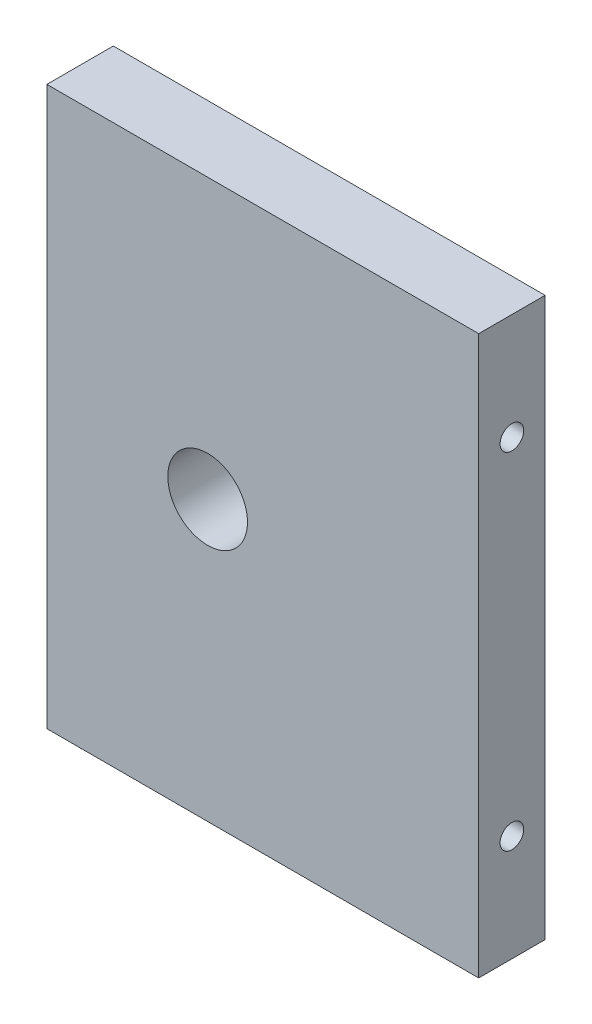
ISO-10303-21;
HEADER;
FILE_DESCRIPTION(('STEP AP214'),'2;1');
FILE_NAME('part.step','',(''),(''),'','','');
FILE_SCHEMA(('AUTOMOTIVE_DESIGN { 1 0 10303 214 1 1 1 1 }'));
ENDSEC;
DATA;
#1=APPLICATION_CONTEXT('core data for automotive mechanical design processes');
#2=APPLICATION_PROTOCOL_DEFINITION('international standard','automotive_design',2000,#1);
#3=PRODUCT_CONTEXT('',#1,'mechanical');
#4=PRODUCT('Part','Part','',(#3));
#5=PRODUCT_RELATED_PRODUCT_CATEGORY('part','',(#4));
#6=PRODUCT_DEFINITION_FORMATION('','',#4);
#7=PRODUCT_DEFINITION_CONTEXT('part definition',#1,'design');
#8=PRODUCT_DEFINITION('design','',#6,#7);
#9=PRODUCT_DEFINITION_SHAPE('','',#8);
#10=(LENGTH_UNIT() NAMED_UNIT(*) SI_UNIT(.MILLI.,.METRE.));
#11=(NAMED_UNIT(*) PLANE_ANGLE_UNIT() SI_UNIT($,.RADIAN.));
#12=(NAMED_UNIT(*) SI_UNIT($,.STERADIAN.) SOLID_ANGLE_UNIT());
#13=UNCERTAINTY_MEASURE_WITH_UNIT(LENGTH_MEASURE(1.E-05),#10,'distance_accuracy_value','');
#14=(GEOMETRIC_REPRESENTATION_CONTEXT(3) GLOBAL_UNCERTAINTY_ASSIGNED_CONTEXT((#13)) GLOBAL_UNIT_ASSIGNED_CONTEXT((#10,
#11,#12)) REPRESENTATION_CONTEXT('',''));
#15=CARTESIAN_POINT('',(0.,0.,0.));
#16=DIRECTION('',(0.,0.,1.));
#17=DIRECTION('',(1.,0.,0.));
#18=AXIS2_PLACEMENT_3D('',#15,#16,#17);
#19=CARTESIAN_POINT('',(0.,0.,5.));
#20=DIRECTION('',(1.,0.,0.));
#21=DIRECTION('',(0.,0.,-1.));
#22=AXIS2_PLACEMENT_3D('',#19,#20,#21);
#23=PLANE('',#22);
#24=CARTESIAN_POINT('',(0.,34.,2.5));
#25=DIRECTION('',(-1.,0.,0.));
#26=DIRECTION('',(0.,0.,1.));
#27=AXIS2_PLACEMENT_3D('',#24,#25,#26);
#28=CIRCLE('',#27,0.889000000000001);
#29=CARTESIAN_POINT('',(0.,34.,3.389));
#30=VERTEX_POINT('',#29);
#31=EDGE_CURVE('E133',#30,#30,#28,.T.);
#32=ORIENTED_EDGE('',*,*,#31,.F.);
#33=EDGE_LOOP('',(#32));
#34=FACE_BOUND('',#33,.T.);
#35=CARTESIAN_POINT('',(0.,8.,2.5));
#36=DIRECTION('',(-1.,0.,0.));
#37=DIRECTION('',(0.,0.,1.));
#38=AXIS2_PLACEMENT_3D('',#35,#36,#37);
#39=CIRCLE('',#38,0.888999999999999);
#40=CARTESIAN_POINT('',(0.,8.,3.389));
#41=VERTEX_POINT('',#40);
#42=EDGE_CURVE('E141',#41,#41,#39,.T.);
#43=ORIENTED_EDGE('',*,*,#42,.F.);
#44=EDGE_LOOP('',(#43));
#45=FACE_BOUND('',#44,.T.);
#46=DIRECTION('',(0.,-1.,0.));
#47=VECTOR('',#46,1.);
#48=CARTESIAN_POINT('',(0.,0.,0.));
#49=LINE('',#48,#47);
#50=CARTESIAN_POINT('',(0.,42.,0.));
#51=VERTEX_POINT('',#50);
#52=CARTESIAN_POINT('',(0.,0.,0.));
#53=VERTEX_POINT('',#52);
#54=EDGE_CURVE('E149',#51,#53,#49,.T.);
#55=ORIENTED_EDGE('',*,*,#54,.T.);
#56=DIRECTION('',(0.,0.,-1.));
#57=VECTOR('',#56,1.);
#58=CARTESIAN_POINT('',(0.,0.,5.));
#59=LINE('',#58,#57);
#60=CARTESIAN_POINT('',(0.,0.,5.));
#61=VERTEX_POINT('',#60);
#62=EDGE_CURVE('E11',#61,#53,#59,.T.);
#63=ORIENTED_EDGE('',*,*,#62,.F.);
#64=DIRECTION('',(0.,-1.,0.));
#65=VECTOR('',#64,1.);
#66=CARTESIAN_POINT('',(0.,0.,5.));
#67=LINE('',#66,#65);
#68=CARTESIAN_POINT('',(0.,42.,5.));
#69=VERTEX_POINT('',#68);
#70=EDGE_CURVE('E150',#69,#61,#67,.T.);
#71=ORIENTED_EDGE('',*,*,#70,.F.);
#72=DIRECTION('',(0.,0.,-1.));
#73=VECTOR('',#72,1.);
#74=CARTESIAN_POINT('',(0.,42.,5.));
#75=LINE('',#74,#73);
#76=EDGE_CURVE('E160',#69,#51,#75,.T.);
#77=ORIENTED_EDGE('',*,*,#76,.T.);
#78=EDGE_LOOP('',(#55,#63,#71,#77));
#79=FACE_BOUND('',#78,.T.);
#80=ADVANCED_FACE('F45',(#34,#45,#79),#23,.F.);
#81=CARTESIAN_POINT('',(0.,0.,5.));
#82=DIRECTION('',(0.,1.,0.));
#83=DIRECTION('',(0.,0.,1.));
#84=AXIS2_PLACEMENT_3D('',#81,#82,#83);
#85=PLANE('',#84);
#86=DIRECTION('',(1.,0.,0.));
#87=VECTOR('',#86,1.);
#88=CARTESIAN_POINT('',(0.,0.,0.));
#89=LINE('',#88,#87);
#90=CARTESIAN_POINT('',(32.5,0.,0.));
#91=VERTEX_POINT('',#90);
#92=EDGE_CURVE('E164',#53,#91,#89,.T.);
#93=ORIENTED_EDGE('',*,*,#92,.T.);
#94=DIRECTION('',(0.,0.,-1.));
#95=VECTOR('',#94,1.);
#96=CARTESIAN_POINT('',(32.5,0.,5.));
#97=LINE('',#96,#95);
#98=CARTESIAN_POINT('',(32.5,0.,5.));
#99=VERTEX_POINT('',#98);
#100=EDGE_CURVE('E54',#99,#91,#97,.T.);
#101=ORIENTED_EDGE('',*,*,#100,.F.);
#102=DIRECTION('',(1.,0.,0.));
#103=VECTOR('',#102,1.);
#104=CARTESIAN_POINT('',(0.,0.,5.));
#105=LINE('',#104,#103);
#106=EDGE_CURVE('E93',#61,#99,#105,.T.);
#107=ORIENTED_EDGE('',*,*,#106,.F.);
#108=ORIENTED_EDGE('',*,*,#62,.T.);
#109=EDGE_LOOP('',(#93,#101,#107,#108));
#110=FACE_BOUND('',#109,.T.);
#111=ADVANCED_FACE('F194',(#110),#85,.F.);
#112=CARTESIAN_POINT('',(32.5,0.,5.));
#113=DIRECTION('',(-1.,0.,0.));
#114=DIRECTION('',(0.,0.,1.));
#115=AXIS2_PLACEMENT_3D('',#112,#113,#114);
#116=PLANE('',#115);
#117=CARTESIAN_POINT('',(32.5,34.,2.5));
#118=DIRECTION('',(1.,0.,0.));
#119=DIRECTION('',(0.,0.,-1.));
#120=AXIS2_PLACEMENT_3D('',#117,#118,#119);
#121=CIRCLE('',#120,0.888999999999987);
#122=CARTESIAN_POINT('',(32.5,34.,1.61100000000001));
#123=VERTEX_POINT('',#122);
#124=EDGE_CURVE('E118',#123,#123,#121,.T.);
#125=ORIENTED_EDGE('',*,*,#124,.F.);
#126=EDGE_LOOP('',(#125));
#127=FACE_BOUND('',#126,.T.);
#128=CARTESIAN_POINT('',(32.5,8.,2.5));
#129=DIRECTION('',(1.,0.,0.));
#130=DIRECTION('',(0.,0.,-1.));
#131=AXIS2_PLACEMENT_3D('',#128,#129,#130);
#132=CIRCLE('',#131,0.888999999999989);
#133=CARTESIAN_POINT('',(32.5,8.,1.61100000000001));
#134=VERTEX_POINT('',#133);
#135=EDGE_CURVE('E117',#134,#134,#132,.T.);
#136=ORIENTED_EDGE('',*,*,#135,.F.);
#137=EDGE_LOOP('',(#136));
#138=FACE_BOUND('',#137,.T.);
#139=DIRECTION('',(0.,1.,0.));
#140=VECTOR('',#139,1.);
#141=CARTESIAN_POINT('',(32.5,0.,0.));
#142=LINE('',#141,#140);
#143=CARTESIAN_POINT('',(32.5,42.,0.));
#144=VERTEX_POINT('',#143);
#145=EDGE_CURVE('E80',#91,#144,#142,.T.);
#146=ORIENTED_EDGE('',*,*,#145,.T.);
#147=DIRECTION('',(0.,0.,-1.));
#148=VECTOR('',#147,1.);
#149=CARTESIAN_POINT('',(32.5,42.,5.));
#150=LINE('',#149,#148);
#151=CARTESIAN_POINT('',(32.5,42.,5.));
#152=VERTEX_POINT('',#151);
#153=EDGE_CURVE('E173',#152,#144,#150,.T.);
#154=ORIENTED_EDGE('',*,*,#153,.F.);
#155=DIRECTION('',(0.,1.,0.));
#156=VECTOR('',#155,1.);
#157=CARTESIAN_POINT('',(32.5,0.,5.));
#158=LINE('',#157,#156);
#159=EDGE_CURVE('E155',#99,#152,#158,.T.);
#160=ORIENTED_EDGE('',*,*,#159,.F.);
#161=ORIENTED_EDGE('',*,*,#100,.T.);
#162=EDGE_LOOP('',(#146,#154,#160,#161));
#163=FACE_BOUND('',#162,.T.);
#164=ADVANCED_FACE('F177',(#127,#138,#163),#116,.F.);
#165=CARTESIAN_POINT('',(0.,42.,5.));
#166=DIRECTION('',(0.,-1.,0.));
#167=DIRECTION('',(0.,0.,-1.));
#168=AXIS2_PLACEMENT_3D('',#165,#166,#167);
#169=PLANE('',#168);
#170=DIRECTION('',(-1.,0.,0.));
#171=VECTOR('',#170,1.);
#172=CARTESIAN_POINT('',(0.,42.,0.));
#173=LINE('',#172,#171);
#174=EDGE_CURVE('E86',#144,#51,#173,.T.);
#175=ORIENTED_EDGE('',*,*,#174,.T.);
#176=ORIENTED_EDGE('',*,*,#76,.F.);
#177=DIRECTION('',(-1.,0.,0.));
#178=VECTOR('',#177,1.);
#179=CARTESIAN_POINT('',(0.,42.,5.));
#180=LINE('',#179,#178);
#181=EDGE_CURVE('E62',#152,#69,#180,.T.);
#182=ORIENTED_EDGE('',*,*,#181,.F.);
#183=ORIENTED_EDGE('',*,*,#153,.T.);
#184=EDGE_LOOP('',(#175,#176,#182,#183));
#185=FACE_BOUND('',#184,.T.);
#186=ADVANCED_FACE('F184',(#185),#169,.F.);
#187=CARTESIAN_POINT('',(0.,0.,5.));
#188=DIRECTION('',(0.,0.,-1.));
#189=DIRECTION('',(-1.,0.,0.));
#190=AXIS2_PLACEMENT_3D('',#187,#188,#189);
#191=PLANE('',#190);
#192=CARTESIAN_POINT('',(12.1,21.,5.));
#193=DIRECTION('',(0.,0.,-1.));
#194=DIRECTION('',(-1.,0.,0.));
#195=AXIS2_PLACEMENT_3D('',#192,#193,#194);
#196=CIRCLE('',#195,3.);
#197=CARTESIAN_POINT('',(9.1,21.,5.));
#198=VERTEX_POINT('',#197);
#199=EDGE_CURVE('E126',#198,#198,#196,.T.);
#200=ORIENTED_EDGE('',*,*,#199,.T.);
#201=EDGE_LOOP('',(#200));
#202=FACE_BOUND('',#201,.T.);
#203=ORIENTED_EDGE('',*,*,#70,.T.);
#204=ORIENTED_EDGE('',*,*,#106,.T.);
#205=ORIENTED_EDGE('',*,*,#159,.T.);
#206=ORIENTED_EDGE('',*,*,#181,.T.);
#207=EDGE_LOOP('',(#203,#204,#205,#206));
#208=FACE_BOUND('',#207,.T.);
#209=ADVANCED_FACE('F186',(#202,#208),#191,.F.);
#210=CARTESIAN_POINT('',(0.,0.,0.));
#211=DIRECTION('',(0.,0.,-1.));
#212=DIRECTION('',(-1.,0.,0.));
#213=AXIS2_PLACEMENT_3D('',#210,#211,#212);
#214=PLANE('',#213);
#215=CARTESIAN_POINT('',(12.1,21.,0.));
#216=DIRECTION('',(0.,0.,-1.));
#217=DIRECTION('',(-1.,0.,0.));
#218=AXIS2_PLACEMENT_3D('',#215,#216,#217);
#219=CIRCLE('',#218,3.);
#220=CARTESIAN_POINT('',(9.1,21.,0.));
#221=VERTEX_POINT('',#220);
#222=EDGE_CURVE('E230',#221,#221,#219,.T.);
#223=ORIENTED_EDGE('',*,*,#222,.F.);
#224=EDGE_LOOP('',(#223));
#225=FACE_BOUND('',#224,.T.);
#226=ORIENTED_EDGE('',*,*,#54,.F.);
#227=ORIENTED_EDGE('',*,*,#174,.F.);
#228=ORIENTED_EDGE('',*,*,#145,.F.);
#229=ORIENTED_EDGE('',*,*,#92,.F.);
#230=EDGE_LOOP('',(#226,#227,#228,#229));
#231=FACE_BOUND('',#230,.T.);
#232=ADVANCED_FACE('F180',(#225,#231),#214,.T.);
#233=CARTESIAN_POINT('',(7.4658349096845,8.,2.5));
#234=DIRECTION('',(-1.,0.,0.));
#235=DIRECTION('',(0.,0.,1.));
#236=AXIS2_PLACEMENT_3D('',#233,#234,#235);
#237=CONICAL_SURFACE('',#236,0.888999999999999,1.02974425867665);
#238=CARTESIAN_POINT('',(8.,8.,2.5));
#239=VERTEX_POINT('',#238);
#240=VERTEX_LOOP('',#239);
#241=FACE_BOUND('',#240,.T.);
#242=CARTESIAN_POINT('',(7.4658349096845,8.,2.5));
#243=DIRECTION('',(-1.,0.,0.));
#244=DIRECTION('',(0.,0.,1.));
#245=AXIS2_PLACEMENT_3D('',#242,#243,#244);
#246=CIRCLE('',#245,0.888999999999999);
#247=CARTESIAN_POINT('',(7.4658349096845,8.,3.389));
#248=VERTEX_POINT('',#247);
#249=EDGE_CURVE('E145',#248,#248,#246,.T.);
#250=ORIENTED_EDGE('',*,*,#249,.T.);
#251=EDGE_LOOP('',(#250));
#252=FACE_BOUND('',#251,.T.);
#253=ADVANCED_FACE('F210',(#241,#252),#237,.F.);
#254=CARTESIAN_POINT('',(0.,8.,2.5));
#255=DIRECTION('',(-1.,0.,0.));
#256=DIRECTION('',(0.,0.,1.));
#257=AXIS2_PLACEMENT_3D('',#254,#255,#256);
#258=CYLINDRICAL_SURFACE('',#257,0.888999999999999);
#259=ORIENTED_EDGE('',*,*,#249,.F.);
#260=EDGE_LOOP('',(#259));
#261=FACE_BOUND('',#260,.T.);
#262=ORIENTED_EDGE('',*,*,#42,.T.);
#263=EDGE_LOOP('',(#262));
#264=FACE_BOUND('',#263,.T.);
#265=ADVANCED_FACE('F207',(#261,#264),#258,.F.);
#266=CARTESIAN_POINT('',(7.4658349096845,34.,2.5));
#267=DIRECTION('',(-1.,0.,0.));
#268=DIRECTION('',(0.,0.,1.));
#269=AXIS2_PLACEMENT_3D('',#266,#267,#268);
#270=CONICAL_SURFACE('',#269,0.889000000000001,1.02974425867665);
#271=CARTESIAN_POINT('',(8.,34.,2.5));
#272=VERTEX_POINT('',#271);
#273=VERTEX_LOOP('',#272);
#274=FACE_BOUND('',#273,.T.);
#275=CARTESIAN_POINT('',(7.4658349096845,34.,2.5));
#276=DIRECTION('',(-1.,0.,0.));
#277=DIRECTION('',(0.,0.,1.));
#278=AXIS2_PLACEMENT_3D('',#275,#276,#277);
#279=CIRCLE('',#278,0.889000000000001);
#280=CARTESIAN_POINT('',(7.4658349096845,34.,3.389));
#281=VERTEX_POINT('',#280);
#282=EDGE_CURVE('E137',#281,#281,#279,.T.);
#283=ORIENTED_EDGE('',*,*,#282,.T.);
#284=EDGE_LOOP('',(#283));
#285=FACE_BOUND('',#284,.T.);
#286=ADVANCED_FACE('F209',(#274,#285),#270,.F.);
#287=CARTESIAN_POINT('',(0.,34.,2.5));
#288=DIRECTION('',(-1.,0.,0.));
#289=DIRECTION('',(0.,0.,1.));
#290=AXIS2_PLACEMENT_3D('',#287,#288,#289);
#291=CYLINDRICAL_SURFACE('',#290,0.889000000000001);
#292=ORIENTED_EDGE('',*,*,#282,.F.);
#293=EDGE_LOOP('',(#292));
#294=FACE_BOUND('',#293,.T.);
#295=ORIENTED_EDGE('',*,*,#31,.T.);
#296=EDGE_LOOP('',(#295));
#297=FACE_BOUND('',#296,.T.);
#298=ADVANCED_FACE('F217',(#294,#297),#291,.F.);
#299=CARTESIAN_POINT('',(25.0341650903155,8.,2.5));
#300=DIRECTION('',(1.,0.,0.));
#301=DIRECTION('',(0.,0.,-1.));
#302=AXIS2_PLACEMENT_3D('',#299,#300,#301);
#303=CONICAL_SURFACE('',#302,0.888999999999999,1.02974425867665);
#304=CARTESIAN_POINT('',(24.5,8.,2.5));
#305=VERTEX_POINT('',#304);
#306=VERTEX_LOOP('',#305);
#307=FACE_BOUND('',#306,.T.);
#308=CARTESIAN_POINT('',(25.0341650903155,8.,2.5));
#309=DIRECTION('',(1.,0.,0.));
#310=DIRECTION('',(0.,0.,-1.));
#311=AXIS2_PLACEMENT_3D('',#308,#309,#310);
#312=CIRCLE('',#311,0.888999999999999);
#313=CARTESIAN_POINT('',(25.0341650903155,8.,1.611));
#314=VERTEX_POINT('',#313);
#315=EDGE_CURVE('E123',#314,#314,#312,.T.);
#316=ORIENTED_EDGE('',*,*,#315,.T.);
#317=EDGE_LOOP('',(#316));
#318=FACE_BOUND('',#317,.T.);
#319=ADVANCED_FACE('F248',(#307,#318),#303,.F.);
#320=CARTESIAN_POINT('',(32.5,8.,2.5));
#321=DIRECTION('',(1.,0.,0.));
#322=DIRECTION('',(0.,0.,-1.));
#323=AXIS2_PLACEMENT_3D('',#320,#321,#322);
#324=CYLINDRICAL_SURFACE('',#323,0.888999999999994);
#325=ORIENTED_EDGE('',*,*,#315,.F.);
#326=EDGE_LOOP('',(#325));
#327=FACE_BOUND('',#326,.T.);
#328=ORIENTED_EDGE('',*,*,#135,.T.);
#329=EDGE_LOOP('',(#328));
#330=FACE_BOUND('',#329,.T.);
#331=ADVANCED_FACE('F110',(#327,#330),#324,.F.);
#332=CARTESIAN_POINT('',(25.0341650903155,34.,2.5));
#333=DIRECTION('',(1.,0.,0.));
#334=DIRECTION('',(0.,0.,-1.));
#335=AXIS2_PLACEMENT_3D('',#332,#333,#334);
#336=CONICAL_SURFACE('',#335,0.889000000000001,1.02974425867665);
#337=CARTESIAN_POINT('',(24.5,34.,2.5));
#338=VERTEX_POINT('',#337);
#339=VERTEX_LOOP('',#338);
#340=FACE_BOUND('',#339,.T.);
#341=CARTESIAN_POINT('',(25.0341650903155,34.,2.5));
#342=DIRECTION('',(1.,0.,0.));
#343=DIRECTION('',(0.,0.,-1.));
#344=AXIS2_PLACEMENT_3D('',#341,#342,#343);
#345=CIRCLE('',#344,0.889000000000001);
#346=CARTESIAN_POINT('',(25.0341650903155,34.,1.611));
#347=VERTEX_POINT('',#346);
#348=EDGE_CURVE('E114',#347,#347,#345,.T.);
#349=ORIENTED_EDGE('',*,*,#348,.T.);
#350=EDGE_LOOP('',(#349));
#351=FACE_BOUND('',#350,.T.);
#352=ADVANCED_FACE('F106',(#340,#351),#336,.F.);
#353=CARTESIAN_POINT('',(32.5,34.,2.5));
#354=DIRECTION('',(1.,0.,0.));
#355=DIRECTION('',(0.,0.,-1.));
#356=AXIS2_PLACEMENT_3D('',#353,#354,#355);
#357=CYLINDRICAL_SURFACE('',#356,0.888999999999994);
#358=ORIENTED_EDGE('',*,*,#348,.F.);
#359=EDGE_LOOP('',(#358));
#360=FACE_BOUND('',#359,.T.);
#361=ORIENTED_EDGE('',*,*,#124,.T.);
#362=EDGE_LOOP('',(#361));
#363=FACE_BOUND('',#362,.T.);
#364=ADVANCED_FACE('F109',(#360,#363),#357,.F.);
#365=CARTESIAN_POINT('',(12.1,21.,5.));
#366=DIRECTION('',(0.,0.,-1.));
#367=DIRECTION('',(-1.,0.,0.));
#368=AXIS2_PLACEMENT_3D('',#365,#366,#367);
#369=CYLINDRICAL_SURFACE('',#368,3.);
#370=ORIENTED_EDGE('',*,*,#199,.F.);
#371=EDGE_LOOP('',(#370));
#372=FACE_BOUND('',#371,.T.);
#373=ORIENTED_EDGE('',*,*,#222,.T.);
#374=EDGE_LOOP('',(#373));
#375=FACE_BOUND('',#374,.T.);
#376=ADVANCED_FACE('F238',(#372,#375),#369,.F.);
#377=CLOSED_SHELL('',(#80,#111,#164,#186,#209,#232,#253,#265,#286,#298,#319,#331,#352,#364,#376));
#378=MANIFOLD_SOLID_BREP('B2',#377);
#379=ADVANCED_BREP_SHAPE_REPRESENTATION('',(#18,#378),#14);
#380=SHAPE_DEFINITION_REPRESENTATION(#9,#379);
ENDSEC;
END-ISO-10303-21;
